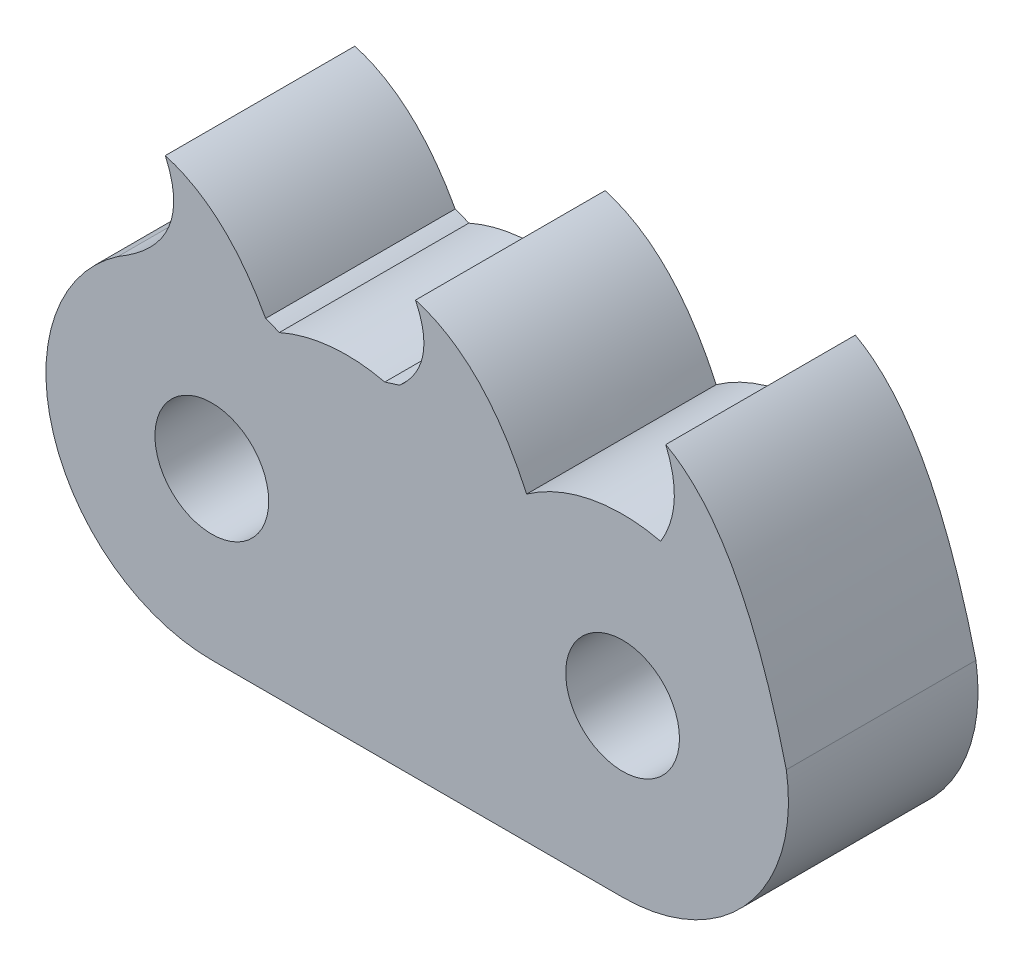
ISO-10303-21;
HEADER;
FILE_DESCRIPTION(('STEP AP214'),'2;1');
FILE_NAME('part.step','',(''),(''),'','','');
FILE_SCHEMA(('AUTOMOTIVE_DESIGN { 1 0 10303 214 1 1 1 1 }'));
ENDSEC;
DATA;
#1=APPLICATION_CONTEXT('core data for automotive mechanical design processes');
#2=APPLICATION_PROTOCOL_DEFINITION('international standard','automotive_design',2000,#1);
#3=PRODUCT_CONTEXT('',#1,'mechanical');
#4=PRODUCT('Part','Part','',(#3));
#5=PRODUCT_RELATED_PRODUCT_CATEGORY('part','',(#4));
#6=PRODUCT_DEFINITION_FORMATION('','',#4);
#7=PRODUCT_DEFINITION_CONTEXT('part definition',#1,'design');
#8=PRODUCT_DEFINITION('design','',#6,#7);
#9=PRODUCT_DEFINITION_SHAPE('','',#8);
#10=(LENGTH_UNIT() NAMED_UNIT(*) SI_UNIT(.MILLI.,.METRE.));
#11=(NAMED_UNIT(*) PLANE_ANGLE_UNIT() SI_UNIT($,.RADIAN.));
#12=(NAMED_UNIT(*) SI_UNIT($,.STERADIAN.) SOLID_ANGLE_UNIT());
#13=UNCERTAINTY_MEASURE_WITH_UNIT(LENGTH_MEASURE(1.E-05),#10,'distance_accuracy_value','');
#14=(GEOMETRIC_REPRESENTATION_CONTEXT(3) GLOBAL_UNCERTAINTY_ASSIGNED_CONTEXT((#13)) GLOBAL_UNIT_ASSIGNED_CONTEXT((#10,
#11,#12)) REPRESENTATION_CONTEXT('',''));
#15=CARTESIAN_POINT('',(0.,0.,0.));
#16=DIRECTION('',(0.,0.,1.));
#17=DIRECTION('',(1.,0.,0.));
#18=AXIS2_PLACEMENT_3D('',#15,#16,#17);
#19=CARTESIAN_POINT('',(0.,-1.75,2.));
#20=DIRECTION('',(0.,1.,0.));
#21=DIRECTION('',(-1.,0.,0.));
#22=AXIS2_PLACEMENT_3D('',#19,#20,#21);
#23=PLANE('',#22);
#24=DIRECTION('',(1.,0.,0.));
#25=VECTOR('',#24,1.);
#26=CARTESIAN_POINT('',(0.,-1.75,0.));
#27=LINE('',#26,#25);
#28=CARTESIAN_POINT('',(2.51583425125565,-1.75,0.));
#29=VERTEX_POINT('',#28);
#30=CARTESIAN_POINT('',(6.84953238319984,-1.75,0.));
#31=VERTEX_POINT('',#30);
#32=EDGE_CURVE('E625',#29,#31,#27,.T.);
#33=ORIENTED_EDGE('',*,*,#32,.T.);
#34=DIRECTION('',(0.,0.,-1.));
#35=VECTOR('',#34,1.);
#36=CARTESIAN_POINT('',(6.84953238319984,-1.75,2.));
#37=LINE('',#36,#35);
#38=CARTESIAN_POINT('',(6.84953238319984,-1.75,2.));
#39=VERTEX_POINT('',#38);
#40=EDGE_CURVE('E258',#39,#31,#37,.T.);
#41=ORIENTED_EDGE('',*,*,#40,.F.);
#42=DIRECTION('',(1.,0.,0.));
#43=VECTOR('',#42,1.);
#44=CARTESIAN_POINT('',(0.,-1.75,2.));
#45=LINE('',#44,#43);
#46=CARTESIAN_POINT('',(2.51583425125565,-1.75,2.));
#47=VERTEX_POINT('',#46);
#48=EDGE_CURVE('E246',#47,#39,#45,.T.);
#49=ORIENTED_EDGE('',*,*,#48,.F.);
#50=DIRECTION('',(0.,0.,-1.));
#51=VECTOR('',#50,1.);
#52=CARTESIAN_POINT('',(2.51583425125565,-1.75,2.));
#53=LINE('',#52,#51);
#54=EDGE_CURVE('E619',#47,#29,#53,.T.);
#55=ORIENTED_EDGE('',*,*,#54,.T.);
#56=EDGE_LOOP('',(#33,#41,#49,#55));
#57=FACE_BOUND('',#56,.T.);
#58=DIRECTION('',(-1.,0.,0.));
#59=VECTOR('',#58,1.);
#60=CARTESIAN_POINT('',(4.68268331722775,-1.75,1.5));
#61=LINE('',#60,#59);
#62=CARTESIAN_POINT('',(6.18268331722775,-1.75,1.5));
#63=VERTEX_POINT('',#62);
#64=CARTESIAN_POINT('',(3.18268331722774,-1.75,1.5));
#65=VERTEX_POINT('',#64);
#66=EDGE_CURVE('E316',#63,#65,#61,.T.);
#67=ORIENTED_EDGE('',*,*,#66,.F.);
#68=DIRECTION('',(0.,0.,-1.));
#69=VECTOR('',#68,1.);
#70=CARTESIAN_POINT('',(6.18268331722775,-1.75,1.));
#71=LINE('',#70,#69);
#72=CARTESIAN_POINT('',(6.18268331722775,-1.75,0.500000000000001));
#73=VERTEX_POINT('',#72);
#74=EDGE_CURVE('E311',#63,#73,#71,.T.);
#75=ORIENTED_EDGE('',*,*,#74,.T.);
#76=DIRECTION('',(-1.,0.,0.));
#77=VECTOR('',#76,1.);
#78=CARTESIAN_POINT('',(4.68268331722775,-1.75,0.500000000000001));
#79=LINE('',#78,#77);
#80=CARTESIAN_POINT('',(3.18268331722774,-1.75,0.500000000000025));
#81=VERTEX_POINT('',#80);
#82=EDGE_CURVE('E313',#73,#81,#79,.T.);
#83=ORIENTED_EDGE('',*,*,#82,.T.);
#84=DIRECTION('',(0.,0.,-1.));
#85=VECTOR('',#84,1.);
#86=CARTESIAN_POINT('',(3.18268331722774,-1.75,1.));
#87=LINE('',#86,#85);
#88=EDGE_CURVE('E130',#65,#81,#87,.T.);
#89=ORIENTED_EDGE('',*,*,#88,.F.);
#90=EDGE_LOOP('',(#67,#75,#83,#89));
#91=FACE_BOUND('',#90,.T.);
#92=ADVANCED_FACE('F126',(#57,#91),#23,.F.);
#93=CARTESIAN_POINT('',(6.84953238319984,0.,2.));
#94=DIRECTION('',(0.,0.,-1.));
#95=DIRECTION('',(-1.,0.,0.));
#96=AXIS2_PLACEMENT_3D('',#93,#94,#95);
#97=CYLINDRICAL_SURFACE('',#96,1.75);
#98=CARTESIAN_POINT('',(6.84953238319984,0.,0.));
#99=DIRECTION('',(0.,0.,1.));
#100=DIRECTION('',(1.,0.,0.));
#101=AXIS2_PLACEMENT_3D('',#98,#99,#100);
#102=CIRCLE('',#101,1.75);
#103=CARTESIAN_POINT('',(7.25105532154827,1.70331421939114,0.));
#104=VERTEX_POINT('',#103);
#105=CARTESIAN_POINT('',(5.83728137693173,1.42753210132354,0.));
#106=VERTEX_POINT('',#105);
#107=EDGE_CURVE('E545',#104,#106,#102,.T.);
#108=ORIENTED_EDGE('',*,*,#107,.T.);
#109=DIRECTION('',(0.,0.,-1.));
#110=VECTOR('',#109,1.);
#111=CARTESIAN_POINT('',(5.83728137693173,1.42753210132354,2.));
#112=LINE('',#111,#110);
#113=CARTESIAN_POINT('',(5.83728137693173,1.42753210132354,2.));
#114=VERTEX_POINT('',#113);
#115=EDGE_CURVE('E12',#114,#106,#112,.T.);
#116=ORIENTED_EDGE('',*,*,#115,.F.);
#117=CARTESIAN_POINT('',(6.84953238319984,0.,2.));
#118=DIRECTION('',(0.,0.,1.));
#119=DIRECTION('',(1.,0.,0.));
#120=AXIS2_PLACEMENT_3D('',#117,#118,#119);
#121=CIRCLE('',#120,1.75);
#122=CARTESIAN_POINT('',(7.25105532154827,1.70331421939114,2.));
#123=VERTEX_POINT('',#122);
#124=EDGE_CURVE('E554',#123,#114,#121,.T.);
#125=ORIENTED_EDGE('',*,*,#124,.F.);
#126=DIRECTION('',(0.,0.,-1.));
#127=VECTOR('',#126,1.);
#128=CARTESIAN_POINT('',(7.25105532154827,1.70331421939114,2.));
#129=LINE('',#128,#127);
#130=EDGE_CURVE('E263',#123,#104,#129,.T.);
#131=ORIENTED_EDGE('',*,*,#130,.T.);
#132=EDGE_LOOP('',(#108,#116,#125,#131));
#133=FACE_BOUND('',#132,.T.);
#134=ADVANCED_FACE('F128',(#133),#97,.T.);
#135=CARTESIAN_POINT('',(5.83728137693173,1.42753210132354,2.));
#136=CARTESIAN_POINT('',(5.39046219265095,2.40304552680193,2.));
#137=CARTESIAN_POINT('',(4.66492546130629,2.6140348632016,2.));
#138=B_SPLINE_CURVE_WITH_KNOTS('',2,(#135,#136,#137),.UNSPECIFIED.,.F.,.F.,(3,3),
(0.307788008353028,1.),.UNSPECIFIED.);
#139=DIRECTION('',(0.,0.,-1.));
#140=VECTOR('',#139,1.);
#141=SURFACE_OF_LINEAR_EXTRUSION('',#138,#140);
#142=CARTESIAN_POINT('',(5.83728137693173,1.42753210132354,0.));
#143=CARTESIAN_POINT('',(5.39046219265095,2.40304552680193,0.));
#144=CARTESIAN_POINT('',(4.66492546130629,2.6140348632016,0.));
#145=B_SPLINE_CURVE_WITH_KNOTS('',2,(#142,#143,#144),.UNSPECIFIED.,.F.,.F.,(3,3),
(0.307788008353028,1.),.UNSPECIFIED.);
#146=CARTESIAN_POINT('',(4.66492546130629,2.6140348632016,0.));
#147=VERTEX_POINT('',#146);
#148=EDGE_CURVE('E653',#106,#147,#145,.T.);
#149=ORIENTED_EDGE('',*,*,#148,.T.);
#150=DIRECTION('',(0.,0.,-1.));
#151=VECTOR('',#150,1.);
#152=CARTESIAN_POINT('',(4.66492546130629,2.6140348632016,2.));
#153=LINE('',#152,#151);
#154=CARTESIAN_POINT('',(4.66492546130629,2.6140348632016,2.));
#155=VERTEX_POINT('',#154);
#156=EDGE_CURVE('E136',#155,#147,#153,.T.);
#157=ORIENTED_EDGE('',*,*,#156,.F.);
#158=EDGE_CURVE('E209',#114,#155,#138,.T.);
#159=ORIENTED_EDGE('',*,*,#158,.F.);
#160=ORIENTED_EDGE('',*,*,#115,.T.);
#161=EDGE_LOOP('',(#149,#157,#159,#160));
#162=FACE_BOUND('',#161,.T.);
#163=ADVANCED_FACE('F568',(#162),#141,.F.);
#164=CARTESIAN_POINT('',(4.66492546130629,2.6140348632016,2.));
#165=CARTESIAN_POINT('',(4.82431896573802,2.28349366662164,2.));
#166=CARTESIAN_POINT('',(4.76874033175528,1.99631470279634,2.));
#167=CARTESIAN_POINT('',(4.49818955935441,1.75249797172241,2.));
#168=B_SPLINE_CURVE_WITH_KNOTS('',3,(#164,#165,#166,#167),.UNSPECIFIED.,.F.,.F.,(4,4),(0.,
0.79202093785679),.UNSPECIFIED.);
#169=DIRECTION('',(0.,0.,-1.));
#170=VECTOR('',#169,1.);
#171=SURFACE_OF_LINEAR_EXTRUSION('',#168,#170);
#172=CARTESIAN_POINT('',(4.66492546130629,2.6140348632016,0.));
#173=CARTESIAN_POINT('',(4.82431896573802,2.28349366662164,0.));
#174=CARTESIAN_POINT('',(4.76874033175528,1.99631470279634,0.));
#175=CARTESIAN_POINT('',(4.49818955935441,1.75249797172241,0.));
#176=B_SPLINE_CURVE_WITH_KNOTS('',3,(#172,#173,#174,#175),.UNSPECIFIED.,.F.,.F.,(4,4),(0.,
0.79202093785679),.UNSPECIFIED.);
#177=CARTESIAN_POINT('',(4.49818955935441,1.75249797172241,0.));
#178=VERTEX_POINT('',#177);
#179=EDGE_CURVE('E648',#147,#178,#176,.T.);
#180=ORIENTED_EDGE('',*,*,#179,.T.);
#181=DIRECTION('',(0.,0.,-1.));
#182=VECTOR('',#181,1.);
#183=CARTESIAN_POINT('',(4.49818955935441,1.75249797172241,2.));
#184=LINE('',#183,#182);
#185=CARTESIAN_POINT('',(4.49818955935441,1.75249797172241,2.));
#186=VERTEX_POINT('',#185);
#187=EDGE_CURVE('E641',#186,#178,#184,.T.);
#188=ORIENTED_EDGE('',*,*,#187,.F.);
#189=EDGE_CURVE('E560',#155,#186,#168,.T.);
#190=ORIENTED_EDGE('',*,*,#189,.F.);
#191=ORIENTED_EDGE('',*,*,#156,.T.);
#192=EDGE_LOOP('',(#180,#188,#190,#191));
#193=FACE_BOUND('',#192,.T.);
#194=ADVANCED_FACE('F571',(#193),#171,.F.);
#195=CARTESIAN_POINT('',(-0.0982208642846311,0.313799983011989,2.));
#196=DIRECTION('',(-0.298713751810146,0.954342755240226,0.));
#197=DIRECTION('',(-0.954342755240226,-0.298713751810146,0.));
#198=AXIS2_PLACEMENT_3D('',#195,#196,#197);
#199=PLANE('',#198);
#200=DIRECTION('',(0.954342755240226,0.298713751810146,0.));
#201=VECTOR('',#200,1.);
#202=CARTESIAN_POINT('',(-0.0982208642846311,0.313799983011989,0.));
#203=LINE('',#202,#201);
#204=CARTESIAN_POINT('',(4.34105532154827,1.70331421939112,0.));
#205=VERTEX_POINT('',#204);
#206=EDGE_CURVE('E656',#205,#178,#203,.T.);
#207=ORIENTED_EDGE('',*,*,#206,.F.);
#208=DIRECTION('',(0.,0.,-1.));
#209=VECTOR('',#208,1.);
#210=CARTESIAN_POINT('',(4.34105532154827,1.70331421939112,2.));
#211=LINE('',#210,#209);
#212=CARTESIAN_POINT('',(4.34105532154827,1.70331421939112,2.));
#213=VERTEX_POINT('',#212);
#214=EDGE_CURVE('E639',#213,#205,#211,.T.);
#215=ORIENTED_EDGE('',*,*,#214,.F.);
#216=DIRECTION('',(0.954342755240226,0.298713751810146,0.));
#217=VECTOR('',#216,1.);
#218=CARTESIAN_POINT('',(-0.0982208642846311,0.313799983011989,2.));
#219=LINE('',#218,#217);
#220=EDGE_CURVE('E708',#213,#186,#219,.T.);
#221=ORIENTED_EDGE('',*,*,#220,.T.);
#222=ORIENTED_EDGE('',*,*,#187,.T.);
#223=EDGE_LOOP('',(#207,#215,#221,#222));
#224=FACE_BOUND('',#223,.T.);
#225=ADVANCED_FACE('F574',(#224),#199,.T.);
#226=CARTESIAN_POINT('',(3.93953238319984,0.,2.));
#227=DIRECTION('',(0.,0.,-1.));
#228=DIRECTION('',(-1.,0.,0.));
#229=AXIS2_PLACEMENT_3D('',#226,#227,#228);
#230=CYLINDRICAL_SURFACE('',#229,1.75);
#231=CARTESIAN_POINT('',(3.93953238319984,0.,0.));
#232=DIRECTION('',(0.,0.,1.));
#233=DIRECTION('',(1.,0.,0.));
#234=AXIS2_PLACEMENT_3D('',#231,#232,#233);
#235=CIRCLE('',#234,1.75);
#236=CARTESIAN_POINT('',(3.22768331722777,1.59867786225826,0.));
#237=VERTEX_POINT('',#236);
#238=EDGE_CURVE('E658',#205,#237,#235,.T.);
#239=ORIENTED_EDGE('',*,*,#238,.T.);
#240=DIRECTION('',(0.,0.,-1.));
#241=VECTOR('',#240,1.);
#242=CARTESIAN_POINT('',(3.22768331722777,1.59867786225826,2.));
#243=LINE('',#242,#241);
#244=CARTESIAN_POINT('',(3.22768331722777,1.59867786225826,2.));
#245=VERTEX_POINT('',#244);
#246=EDGE_CURVE('E636',#245,#237,#243,.T.);
#247=ORIENTED_EDGE('',*,*,#246,.F.);
#248=CARTESIAN_POINT('',(3.93953238319984,0.,2.));
#249=DIRECTION('',(0.,0.,1.));
#250=DIRECTION('',(1.,0.,0.));
#251=AXIS2_PLACEMENT_3D('',#248,#249,#250);
#252=CIRCLE('',#251,1.75);
#253=EDGE_CURVE('E710',#213,#245,#252,.T.);
#254=ORIENTED_EDGE('',*,*,#253,.F.);
#255=ORIENTED_EDGE('',*,*,#214,.T.);
#256=EDGE_LOOP('',(#239,#247,#254,#255));
#257=FACE_BOUND('',#256,.T.);
#258=ADVANCED_FACE('F578',(#257),#230,.T.);
#259=CARTESIAN_POINT('',(2.51583425125565,0.,2.));
#260=DIRECTION('',(0.,0.,-1.));
#261=DIRECTION('',(-1.,0.,0.));
#262=AXIS2_PLACEMENT_3D('',#259,#260,#261);
#263=CYLINDRICAL_SURFACE('',#262,1.75000000000001);
#264=CARTESIAN_POINT('',(2.51583425125565,0.,0.));
#265=DIRECTION('',(0.,0.,1.));
#266=DIRECTION('',(1.,0.,0.));
#267=AXIS2_PLACEMENT_3D('',#264,#265,#266);
#268=CIRCLE('',#267,1.75000000000001);
#269=CARTESIAN_POINT('',(3.08344866121681,1.65538934441553,0.));
#270=VERTEX_POINT('',#269);
#271=EDGE_CURVE('E670',#237,#270,#268,.T.);
#272=ORIENTED_EDGE('',*,*,#271,.T.);
#273=DIRECTION('',(0.,0.,-1.));
#274=VECTOR('',#273,1.);
#275=CARTESIAN_POINT('',(3.08344866121681,1.65538934441553,2.));
#276=LINE('',#275,#274);
#277=CARTESIAN_POINT('',(3.08344866121681,1.65538934441553,2.));
#278=VERTEX_POINT('',#277);
#279=EDGE_CURVE('E633',#278,#270,#276,.T.);
#280=ORIENTED_EDGE('',*,*,#279,.F.);
#281=CARTESIAN_POINT('',(2.51583425125565,0.,2.));
#282=DIRECTION('',(0.,0.,1.));
#283=DIRECTION('',(1.,0.,0.));
#284=AXIS2_PLACEMENT_3D('',#281,#282,#283);
#285=CIRCLE('',#284,1.75000000000001);
#286=EDGE_CURVE('E599',#245,#278,#285,.T.);
#287=ORIENTED_EDGE('',*,*,#286,.F.);
#288=ORIENTED_EDGE('',*,*,#246,.T.);
#289=EDGE_LOOP('',(#272,#280,#287,#288));
#290=FACE_BOUND('',#289,.T.);
#291=ADVANCED_FACE('F582',(#290),#263,.T.);
#292=CARTESIAN_POINT('',(3.08344866121681,1.65538934441552,2.));
#293=CARTESIAN_POINT('',(2.66144855366151,2.42893109234409,2.));
#294=CARTESIAN_POINT('',(2.02492546130629,2.61403486320159,2.));
#295=B_SPLINE_CURVE_WITH_KNOTS('',2,(#292,#293,#294),.UNSPECIFIED.,.F.,.F.,(3,3),
(0.392713148098827,1.),.UNSPECIFIED.);
#296=DIRECTION('',(0.,0.,-1.));
#297=VECTOR('',#296,1.);
#298=SURFACE_OF_LINEAR_EXTRUSION('',#295,#297);
#299=CARTESIAN_POINT('',(3.08344866121681,1.65538934441552,0.));
#300=CARTESIAN_POINT('',(2.66144855366151,2.42893109234409,0.));
#301=CARTESIAN_POINT('',(2.02492546130629,2.61403486320159,0.));
#302=B_SPLINE_CURVE_WITH_KNOTS('',2,(#299,#300,#301),.UNSPECIFIED.,.F.,.F.,(3,3),
(0.392713148098827,1.),.UNSPECIFIED.);
#303=CARTESIAN_POINT('',(2.02492546130629,2.61403486320159,0.));
#304=VERTEX_POINT('',#303);
#305=EDGE_CURVE('E672',#270,#304,#302,.T.);
#306=ORIENTED_EDGE('',*,*,#305,.T.);
#307=DIRECTION('',(0.,0.,-1.));
#308=VECTOR('',#307,1.);
#309=CARTESIAN_POINT('',(2.02492546130629,2.61403486320159,2.));
#310=LINE('',#309,#308);
#311=CARTESIAN_POINT('',(2.02492546130629,2.61403486320159,2.));
#312=VERTEX_POINT('',#311);
#313=EDGE_CURVE('E630',#312,#304,#310,.T.);
#314=ORIENTED_EDGE('',*,*,#313,.F.);
#315=EDGE_CURVE('E593',#278,#312,#295,.T.);
#316=ORIENTED_EDGE('',*,*,#315,.F.);
#317=ORIENTED_EDGE('',*,*,#279,.T.);
#318=EDGE_LOOP('',(#306,#314,#316,#317));
#319=FACE_BOUND('',#318,.T.);
#320=ADVANCED_FACE('F586',(#319),#298,.F.);
#321=CARTESIAN_POINT('',(2.02492546130629,2.61403486320158,2.));
#322=CARTESIAN_POINT('',(2.34198452025452,1.91906428398839,2.));
#323=CARTESIAN_POINT('',(1.52622588148827,1.4433209187448,2.));
#324=B_SPLINE_CURVE_WITH_KNOTS('',2,(#321,#322,#323),.UNSPECIFIED.,.F.,.F.,(3,3),(0.,1.),.UNSPECIFIED.);
#325=DIRECTION('',(0.,0.,-1.));
#326=VECTOR('',#325,1.);
#327=SURFACE_OF_LINEAR_EXTRUSION('',#324,#326);
#328=CARTESIAN_POINT('',(2.02492546130629,2.61403486320158,0.));
#329=CARTESIAN_POINT('',(2.34198452025452,1.91906428398839,0.));
#330=CARTESIAN_POINT('',(1.52622588148827,1.4433209187448,0.));
#331=B_SPLINE_CURVE_WITH_KNOTS('',2,(#328,#329,#330),.UNSPECIFIED.,.F.,.F.,(3,3),(0.,1.),.UNSPECIFIED.);
#332=CARTESIAN_POINT('',(1.52622588148827,1.4433209187448,0.));
#333=VERTEX_POINT('',#332);
#334=EDGE_CURVE('E676',#304,#333,#331,.T.);
#335=ORIENTED_EDGE('',*,*,#334,.T.);
#336=DIRECTION('',(0.,0.,-1.));
#337=VECTOR('',#336,1.);
#338=CARTESIAN_POINT('',(1.52622588148827,1.4433209187448,2.));
#339=LINE('',#338,#337);
#340=CARTESIAN_POINT('',(1.52622588148827,1.4433209187448,2.));
#341=VERTEX_POINT('',#340);
#342=EDGE_CURVE('E623',#341,#333,#339,.T.);
#343=ORIENTED_EDGE('',*,*,#342,.F.);
#344=EDGE_CURVE('E598',#312,#341,#324,.T.);
#345=ORIENTED_EDGE('',*,*,#344,.F.);
#346=ORIENTED_EDGE('',*,*,#313,.T.);
#347=EDGE_LOOP('',(#335,#343,#345,#346));
#348=FACE_BOUND('',#347,.T.);
#349=ADVANCED_FACE('F590',(#348),#327,.F.);
#350=CARTESIAN_POINT('',(2.51583425125565,0.,2.));
#351=DIRECTION('',(0.,0.,-1.));
#352=DIRECTION('',(-1.,0.,0.));
#353=AXIS2_PLACEMENT_3D('',#350,#351,#352);
#354=CYLINDRICAL_SURFACE('',#353,1.75);
#355=CARTESIAN_POINT('',(2.51583425125565,0.,0.));
#356=DIRECTION('',(0.,0.,1.));
#357=DIRECTION('',(1.,0.,0.));
#358=AXIS2_PLACEMENT_3D('',#355,#356,#357);
#359=CIRCLE('',#358,1.75);
#360=EDGE_CURVE('E621',#333,#29,#359,.T.);
#361=ORIENTED_EDGE('',*,*,#360,.T.);
#362=ORIENTED_EDGE('',*,*,#54,.F.);
#363=CARTESIAN_POINT('',(2.51583425125565,0.,2.));
#364=DIRECTION('',(0.,0.,1.));
#365=DIRECTION('',(1.,0.,0.));
#366=AXIS2_PLACEMENT_3D('',#363,#364,#365);
#367=CIRCLE('',#366,1.75);
#368=EDGE_CURVE('E608',#341,#47,#367,.T.);
#369=ORIENTED_EDGE('',*,*,#368,.F.);
#370=ORIENTED_EDGE('',*,*,#342,.T.);
#371=EDGE_LOOP('',(#361,#362,#369,#370));
#372=FACE_BOUND('',#371,.T.);
#373=ADVANCED_FACE('F284',(#372),#354,.T.);
#374=CARTESIAN_POINT('',(6.84953238319984,0.,2.));
#375=DIRECTION('',(0.,0.,-1.));
#376=DIRECTION('',(-1.,0.,0.));
#377=AXIS2_PLACEMENT_3D('',#374,#375,#376);
#378=CYLINDRICAL_SURFACE('',#377,1.75);
#379=CARTESIAN_POINT('',(6.84953238319984,0.,0.));
#380=DIRECTION('',(0.,0.,1.));
#381=DIRECTION('',(1.,0.,0.));
#382=AXIS2_PLACEMENT_3D('',#379,#380,#381);
#383=CIRCLE('',#382,1.75);
#384=CARTESIAN_POINT('',(8.57715983620807,0.27893257897259,0.));
#385=VERTEX_POINT('',#384);
#386=EDGE_CURVE('E255',#31,#385,#383,.T.);
#387=ORIENTED_EDGE('',*,*,#386,.T.);
#388=DIRECTION('',(0.,0.,-1.));
#389=VECTOR('',#388,1.);
#390=CARTESIAN_POINT('',(8.57715983620807,0.27893257897259,2.));
#391=LINE('',#390,#389);
#392=CARTESIAN_POINT('',(8.57715983620807,0.27893257897259,2.));
#393=VERTEX_POINT('',#392);
#394=EDGE_CURVE('E252',#393,#385,#391,.T.);
#395=ORIENTED_EDGE('',*,*,#394,.F.);
#396=CARTESIAN_POINT('',(6.84953238319984,0.,2.));
#397=DIRECTION('',(0.,0.,1.));
#398=DIRECTION('',(1.,0.,0.));
#399=AXIS2_PLACEMENT_3D('',#396,#397,#398);
#400=CIRCLE('',#399,1.75);
#401=EDGE_CURVE('E239',#39,#393,#400,.T.);
#402=ORIENTED_EDGE('',*,*,#401,.F.);
#403=ORIENTED_EDGE('',*,*,#40,.T.);
#404=EDGE_LOOP('',(#387,#395,#402,#403));
#405=FACE_BOUND('',#404,.T.);
#406=ADVANCED_FACE('F253',(#405),#378,.T.);
#407=CARTESIAN_POINT('',(8.57715983620807,0.27893257897259,2.));
#408=CARTESIAN_POINT('',(8.11070004770232,2.17929634087259,2.));
#409=CARTESIAN_POINT('',(7.30492546130629,2.61403486320162,2.));
#410=B_SPLINE_CURVE_WITH_KNOTS('',2,(#407,#408,#409),.UNSPECIFIED.,.F.,.F.,(3,3),(0.,1.),.UNSPECIFIED.);
#411=DIRECTION('',(0.,0.,-1.));
#412=VECTOR('',#411,1.);
#413=SURFACE_OF_LINEAR_EXTRUSION('',#410,#412);
#414=CARTESIAN_POINT('',(8.57715983620807,0.27893257897259,0.));
#415=CARTESIAN_POINT('',(8.11070004770232,2.17929634087259,0.));
#416=CARTESIAN_POINT('',(7.30492546130629,2.61403486320162,0.));
#417=B_SPLINE_CURVE_WITH_KNOTS('',2,(#414,#415,#416),.UNSPECIFIED.,.F.,.F.,(3,3),(0.,1.),.UNSPECIFIED.);
#418=CARTESIAN_POINT('',(7.30492546130629,2.61403486320162,0.));
#419=VERTEX_POINT('',#418);
#420=EDGE_CURVE('E689',#385,#419,#417,.T.);
#421=ORIENTED_EDGE('',*,*,#420,.T.);
#422=DIRECTION('',(0.,0.,-1.));
#423=VECTOR('',#422,1.);
#424=CARTESIAN_POINT('',(7.30492546130629,2.61403486320162,2.));
#425=LINE('',#424,#423);
#426=CARTESIAN_POINT('',(7.30492546130629,2.61403486320162,2.));
#427=VERTEX_POINT('',#426);
#428=EDGE_CURVE('E259',#427,#419,#425,.T.);
#429=ORIENTED_EDGE('',*,*,#428,.F.);
#430=EDGE_CURVE('E243',#393,#427,#410,.T.);
#431=ORIENTED_EDGE('',*,*,#430,.F.);
#432=ORIENTED_EDGE('',*,*,#394,.T.);
#433=EDGE_LOOP('',(#421,#429,#431,#432));
#434=FACE_BOUND('',#433,.T.);
#435=ADVANCED_FACE('F261',(#434),#413,.F.);
#436=CARTESIAN_POINT('',(7.30492546130629,2.61403486320162,2.));
#437=CARTESIAN_POINT('',(7.44147862808272,2.29130715637592,2.));
#438=CARTESIAN_POINT('',(7.42352191489714,1.98773360844841,2.));
#439=CARTESIAN_POINT('',(7.25105532154827,1.70331421939114,2.));
#440=B_SPLINE_CURVE_WITH_KNOTS('',3,(#436,#437,#438,#439),.UNSPECIFIED.,.F.,.F.,(4,4),(0.,
0.66853878617915),.UNSPECIFIED.);
#441=DIRECTION('',(0.,0.,-1.));
#442=VECTOR('',#441,1.);
#443=SURFACE_OF_LINEAR_EXTRUSION('',#440,#442);
#444=CARTESIAN_POINT('',(7.30492546130629,2.61403486320162,0.));
#445=CARTESIAN_POINT('',(7.44147862808272,2.29130715637592,0.));
#446=CARTESIAN_POINT('',(7.42352191489714,1.98773360844841,0.));
#447=CARTESIAN_POINT('',(7.25105532154827,1.70331421939114,0.));
#448=B_SPLINE_CURVE_WITH_KNOTS('',3,(#444,#445,#446,#447),.UNSPECIFIED.,.F.,.F.,(4,4),(0.,
0.66853878617915),.UNSPECIFIED.);
#449=EDGE_CURVE('E201',#419,#104,#448,.T.);
#450=ORIENTED_EDGE('',*,*,#449,.T.);
#451=ORIENTED_EDGE('',*,*,#130,.F.);
#452=EDGE_CURVE('E153',#427,#123,#440,.T.);
#453=ORIENTED_EDGE('',*,*,#452,.F.);
#454=ORIENTED_EDGE('',*,*,#428,.T.);
#455=EDGE_LOOP('',(#450,#451,#453,#454));
#456=FACE_BOUND('',#455,.T.);
#457=ADVANCED_FACE('F280',(#456),#443,.F.);
#458=CARTESIAN_POINT('',(0.,0.,2.));
#459=DIRECTION('',(0.,0.,1.));
#460=DIRECTION('',(1.,0.,0.));
#461=AXIS2_PLACEMENT_3D('',#458,#459,#460);
#462=PLANE('',#461);
#463=CARTESIAN_POINT('',(6.84953238319984,0.,2.));
#464=DIRECTION('',(0.,0.,1.));
#465=DIRECTION('',(1.,0.,0.));
#466=AXIS2_PLACEMENT_3D('',#463,#464,#465);
#467=CIRCLE('',#466,0.6);
#468=CARTESIAN_POINT('',(7.44953238319984,0.,2.));
#469=VERTEX_POINT('',#468);
#470=EDGE_CURVE('E546',#469,#469,#467,.T.);
#471=ORIENTED_EDGE('',*,*,#470,.F.);
#472=EDGE_LOOP('',(#471));
#473=FACE_BOUND('',#472,.T.);
#474=CARTESIAN_POINT('',(2.51583425125565,0.,2.));
#475=DIRECTION('',(0.,0.,1.));
#476=DIRECTION('',(1.,0.,0.));
#477=AXIS2_PLACEMENT_3D('',#474,#475,#476);
#478=CIRCLE('',#477,0.6);
#479=CARTESIAN_POINT('',(3.11583425125565,0.,2.));
#480=VERTEX_POINT('',#479);
#481=EDGE_CURVE('E326',#480,#480,#478,.T.);
#482=ORIENTED_EDGE('',*,*,#481,.F.);
#483=EDGE_LOOP('',(#482));
#484=FACE_BOUND('',#483,.T.);
#485=ORIENTED_EDGE('',*,*,#124,.T.);
#486=ORIENTED_EDGE('',*,*,#158,.T.);
#487=ORIENTED_EDGE('',*,*,#189,.T.);
#488=ORIENTED_EDGE('',*,*,#220,.F.);
#489=ORIENTED_EDGE('',*,*,#253,.T.);
#490=ORIENTED_EDGE('',*,*,#286,.T.);
#491=ORIENTED_EDGE('',*,*,#315,.T.);
#492=ORIENTED_EDGE('',*,*,#344,.T.);
#493=ORIENTED_EDGE('',*,*,#368,.T.);
#494=ORIENTED_EDGE('',*,*,#48,.T.);
#495=ORIENTED_EDGE('',*,*,#401,.T.);
#496=ORIENTED_EDGE('',*,*,#430,.T.);
#497=ORIENTED_EDGE('',*,*,#452,.T.);
#498=EDGE_LOOP('',(#485,#486,#487,#488,#489,#490,#491,#492,#493,#494,#495,#496,#497));
#499=FACE_BOUND('',#498,.T.);
#500=ADVANCED_FACE('F241',(#473,#484,#499),#462,.T.);
#501=CARTESIAN_POINT('',(0.,0.,0.));
#502=DIRECTION('',(0.,0.,1.));
#503=DIRECTION('',(1.,0.,0.));
#504=AXIS2_PLACEMENT_3D('',#501,#502,#503);
#505=PLANE('',#504);
#506=CARTESIAN_POINT('',(6.84953238319984,0.,0.));
#507=DIRECTION('',(0.,0.,1.));
#508=DIRECTION('',(1.,0.,0.));
#509=AXIS2_PLACEMENT_3D('',#506,#507,#508);
#510=CIRCLE('',#509,0.6);
#511=CARTESIAN_POINT('',(7.44953238319984,0.,0.));
#512=VERTEX_POINT('',#511);
#513=EDGE_CURVE('E542',#512,#512,#510,.T.);
#514=ORIENTED_EDGE('',*,*,#513,.T.);
#515=EDGE_LOOP('',(#514));
#516=FACE_BOUND('',#515,.T.);
#517=CARTESIAN_POINT('',(2.51583425125565,0.,0.));
#518=DIRECTION('',(0.,0.,1.));
#519=DIRECTION('',(1.,0.,0.));
#520=AXIS2_PLACEMENT_3D('',#517,#518,#519);
#521=CIRCLE('',#520,0.6);
#522=CARTESIAN_POINT('',(3.11583425125565,0.,0.));
#523=VERTEX_POINT('',#522);
#524=EDGE_CURVE('E549',#523,#523,#521,.T.);
#525=ORIENTED_EDGE('',*,*,#524,.T.);
#526=EDGE_LOOP('',(#525));
#527=FACE_BOUND('',#526,.T.);
#528=ORIENTED_EDGE('',*,*,#107,.F.);
#529=ORIENTED_EDGE('',*,*,#449,.F.);
#530=ORIENTED_EDGE('',*,*,#420,.F.);
#531=ORIENTED_EDGE('',*,*,#386,.F.);
#532=ORIENTED_EDGE('',*,*,#32,.F.);
#533=ORIENTED_EDGE('',*,*,#360,.F.);
#534=ORIENTED_EDGE('',*,*,#334,.F.);
#535=ORIENTED_EDGE('',*,*,#305,.F.);
#536=ORIENTED_EDGE('',*,*,#271,.F.);
#537=ORIENTED_EDGE('',*,*,#238,.F.);
#538=ORIENTED_EDGE('',*,*,#206,.T.);
#539=ORIENTED_EDGE('',*,*,#179,.F.);
#540=ORIENTED_EDGE('',*,*,#148,.F.);
#541=EDGE_LOOP('',(#528,#529,#530,#531,#532,#533,#534,#535,#536,#537,#538,#539,#540));
#542=FACE_BOUND('',#541,.T.);
#543=ADVANCED_FACE('F652',(#516,#527,#542),#505,.F.);
#544=CARTESIAN_POINT('',(2.51583425125565,0.,0.));
#545=DIRECTION('',(0.,0.,1.));
#546=DIRECTION('',(1.,0.,0.));
#547=AXIS2_PLACEMENT_3D('',#544,#545,#546);
#548=CYLINDRICAL_SURFACE('',#547,0.6);
#549=ORIENTED_EDGE('',*,*,#524,.F.);
#550=EDGE_LOOP('',(#549));
#551=FACE_BOUND('',#550,.T.);
#552=ORIENTED_EDGE('',*,*,#481,.T.);
#553=EDGE_LOOP('',(#552));
#554=FACE_BOUND('',#553,.T.);
#555=ADVANCED_FACE('F752',(#551,#554),#548,.F.);
#556=CARTESIAN_POINT('',(6.84953238319984,0.,0.));
#557=DIRECTION('',(0.,0.,1.));
#558=DIRECTION('',(1.,0.,0.));
#559=AXIS2_PLACEMENT_3D('',#556,#557,#558);
#560=CYLINDRICAL_SURFACE('',#559,0.6);
#561=ORIENTED_EDGE('',*,*,#513,.F.);
#562=EDGE_LOOP('',(#561));
#563=FACE_BOUND('',#562,.T.);
#564=ORIENTED_EDGE('',*,*,#470,.T.);
#565=EDGE_LOOP('',(#564));
#566=FACE_BOUND('',#565,.T.);
#567=ADVANCED_FACE('F355',(#563,#566),#560,.F.);
#568=CARTESIAN_POINT('',(5.74017189963838,-0.864977164821273,1.5));
#569=DIRECTION('',(0.894427190999916,0.447213595499959,0.));
#570=DIRECTION('',(0.447213595499959,-0.894427190999916,0.));
#571=AXIS2_PLACEMENT_3D('',#568,#569,#570);
#572=PLANE('',#571);
#573=DIRECTION('',(0.447213595499959,-0.894427190999915,0.));
#574=VECTOR('',#573,1.);
#575=CARTESIAN_POINT('',(5.96142760843306,-1.30748858241064,1.5));
#576=LINE('',#575,#574);
#577=CARTESIAN_POINT('',(5.74017189963838,-0.864977164821273,1.5));
#578=VERTEX_POINT('',#577);
#579=EDGE_CURVE('E323',#578,#63,#576,.T.);
#580=ORIENTED_EDGE('',*,*,#579,.F.);
#581=DIRECTION('',(0.,0.,-1.));
#582=VECTOR('',#581,1.);
#583=CARTESIAN_POINT('',(5.74017189963838,-0.864977164821273,1.));
#584=LINE('',#583,#582);
#585=CARTESIAN_POINT('',(5.74017189963838,-0.864977164821273,0.500000000000001));
#586=VERTEX_POINT('',#585);
#587=EDGE_CURVE('E384',#578,#586,#584,.T.);
#588=ORIENTED_EDGE('',*,*,#587,.T.);
#589=DIRECTION('',(0.447213595499959,-0.894427190999915,0.));
#590=VECTOR('',#589,1.);
#591=CARTESIAN_POINT('',(5.96142760843306,-1.30748858241064,0.500000000000001));
#592=LINE('',#591,#590);
#593=EDGE_CURVE('E408',#586,#73,#592,.T.);
#594=ORIENTED_EDGE('',*,*,#593,.T.);
#595=ORIENTED_EDGE('',*,*,#74,.F.);
#596=EDGE_LOOP('',(#580,#588,#594,#595));
#597=FACE_BOUND('',#596,.T.);
#598=ADVANCED_FACE('F344',(#597),#572,.F.);
#599=CARTESIAN_POINT('',(3.18268331722774,-1.75,1.5));
#600=CARTESIAN_POINT('',(3.18268331722774,-1.75,0.5));
#601=CARTESIAN_POINT('',(3.21955926869353,-1.67624809706844,1.5));
#602=CARTESIAN_POINT('',(3.21955926869353,-1.67624809706844,0.500000000000001));
#603=CARTESIAN_POINT('',(3.29331117162509,-1.52874429120532,1.5));
#604=CARTESIAN_POINT('',(3.29331117162509,-1.52874429120532,0.500000000000001));
#605=CARTESIAN_POINT('',(3.40393902602243,-1.30748858241064,1.5));
#606=CARTESIAN_POINT('',(3.40393902602243,-1.30748858241064,0.500000000000001));
#607=CARTESIAN_POINT('',(3.51456688041977,-1.08623287361596,1.5));
#608=CARTESIAN_POINT('',(3.51456688041977,-1.08623287361596,0.500000000000001));
#609=CARTESIAN_POINT('',(3.58834009278165,-0.938686448892191,1.5));
#610=CARTESIAN_POINT('',(3.58834009278165,-0.938686448892191,0.5));
#611=CARTESIAN_POINT('',(3.67870969448504,-0.757947245485417,1.5));
#612=CARTESIAN_POINT('',(3.67870969448504,-0.757947245485417,0.500000000000001));
#613=CARTESIAN_POINT('',(3.78377544634851,-0.543015437318166,1.5));
#614=CARTESIAN_POINT('',(3.78377544634851,-0.543015437318166,0.500000000000001));
#615=CARTESIAN_POINT('',(3.93558498605423,-0.217797228625209,1.5));
#616=CARTESIAN_POINT('',(3.93558498605423,-0.217797228625209,0.5));
#617=CARTESIAN_POINT('',(4.08153451424278,0.110092623051633,1.5));
#618=CARTESIAN_POINT('',(4.08153451424278,0.110092623051633,0.500000000000001));
#619=CARTESIAN_POINT('',(4.1748996077952,0.330404865082299,1.5));
#620=CARTESIAN_POINT('',(4.1748996077952,0.330404865082299,0.500000000000001));
#621=CARTESIAN_POINT('',(4.25811017208123,0.531765281121926,1.5));
#622=CARTESIAN_POINT('',(4.25811017208123,0.531765281121926,0.500000000000001));
#623=CARTESIAN_POINT('',(4.38802116405715,0.690444525895376,1.5));
#624=CARTESIAN_POINT('',(4.38802116405715,0.690444525895376,0.5));
#625=CARTESIAN_POINT('',(4.68268331722775,0.779920410617761,1.5));
#626=CARTESIAN_POINT('',(4.68268331722775,0.779920410617761,0.500000000000001));
#627=CARTESIAN_POINT('',(4.97734547039833,0.690444525895379,1.5));
#628=CARTESIAN_POINT('',(4.97734547039833,0.690444525895379,0.5));
#629=CARTESIAN_POINT('',(5.10725646237426,0.53176528112193,1.5));
#630=CARTESIAN_POINT('',(5.10725646237426,0.53176528112193,0.500000000000001));
#631=CARTESIAN_POINT('',(5.19046702666029,0.3304048650823,1.5));
#632=CARTESIAN_POINT('',(5.19046702666029,0.3304048650823,0.500000000000001));
#633=CARTESIAN_POINT('',(5.28383212021272,0.110092623051633,1.5));
#634=CARTESIAN_POINT('',(5.28383212021272,0.110092623051633,0.5));
#635=CARTESIAN_POINT('',(5.42978164840126,-0.217797228625209,1.5));
#636=CARTESIAN_POINT('',(5.42978164840126,-0.217797228625209,0.500000000000001));
#637=CARTESIAN_POINT('',(5.581591188107,-0.543015437318166,1.5));
#638=CARTESIAN_POINT('',(5.581591188107,-0.543015437318166,0.5));
#639=CARTESIAN_POINT('',(5.68667161533285,-0.757976596210199,1.5));
#640=CARTESIAN_POINT('',(5.68667161533285,-0.757976596210199,0.500000000000001));
#641=CARTESIAN_POINT('',(5.74017189963838,-0.864977164821273,1.5));
#642=CARTESIAN_POINT('',(5.74017189963838,-0.864977164821273,0.500000000000001));
#643=B_SPLINE_SURFACE_WITH_KNOTS('',3,1,((#599,#600),(#601,#602),(#603,#604),(#605,#606),(#607,
#608),(#609,#610),(#611,#612),(#613,#614),(#615,#616),(#617,#618),(#619,#620),(#621,#622),(#623,
#624),(#625,#626),(#627,#628),(#629,#630),(#631,#632),(#633,#634),(#635,#636),(#637,#638),(#639,
#640),(#641,#642)),.UNSPECIFIED.,.F.,.F.,.F.,(4,1,1,1,2,1,1,1,2,1,1,1,2,1,1,1,4),(2,2),(0.,
0.0490503493997491,0.0981006987994982,0.147151048199247,0.196201397598997,0.26742519261781,
0.338648987636624,0.409872782655438,0.481096577674252,0.539598638236875,0.598100698799498,
0.656602759362121,0.715104819924745,0.786328614943558,0.857552409962372,0.928776204981186,1.),
(0.,1.),.UNSPECIFIED.);
#644=DIRECTION('',(0.447213595499958,0.894427190999916,0.));
#645=VECTOR('',#644,1.);
#646=CARTESIAN_POINT('',(3.18268331722774,-1.75,1.5));
#647=LINE('',#646,#645);
#648=CARTESIAN_POINT('',(3.62519473481672,-0.864977164822053,1.5));
#649=VERTEX_POINT('',#648);
#650=EDGE_CURVE('E486',#65,#649,#647,.T.);
#651=DIRECTION('',(0.447213595499958,0.894427190999916,0.));
#652=VECTOR('',#651,1.);
#653=CARTESIAN_POINT('',(3.18268331722774,-1.75,0.500000000000001));
#654=LINE('',#653,#652);
#655=CARTESIAN_POINT('',(3.62519473481672,-0.864977164822053,0.500000000000001));
#656=VERTEX_POINT('',#655);
#657=EDGE_CURVE('E538',#81,#656,#654,.T.);
#658=CARTESIAN_POINT('',(-14.2633490851812,8.07929474517789,0.500000000000001));
#659=DIRECTION('',(0.,0.,1.));
#660=DIRECTION('',(-1.,0.,0.));
#661=AXIS2_PLACEMENT_3D('',#658,#659,#660);
#662=CIRCLE('',#661,20.);
#663=CARTESIAN_POINT('',(4.22058496594948,0.440958408418972,0.500000000000001));
#664=VERTEX_POINT('',#663);
#665=EDGE_CURVE('E526',#656,#664,#662,.T.);
#666=CARTESIAN_POINT('',(4.68268331722775,0.249999999999999,0.500000000000001));
#667=DIRECTION('',(0.,0.,-1.));
#668=DIRECTION('',(-1.,0.,0.));
#669=AXIS2_PLACEMENT_3D('',#666,#667,#668);
#670=CIRCLE('',#669,0.500000000000002);
#671=CARTESIAN_POINT('',(5.14478166850662,0.440958408417519,0.500000000000001));
#672=VERTEX_POINT('',#671);
#673=EDGE_CURVE('E383',#664,#672,#670,.T.);
#674=CARTESIAN_POINT('',(23.6287157196367,8.07929474517789,0.500000000000001));
#675=DIRECTION('',(0.,0.,1.));
#676=DIRECTION('',(-1.,0.,0.));
#677=AXIS2_PLACEMENT_3D('',#674,#675,#676);
#678=CIRCLE('',#677,20.);
#679=EDGE_CURVE('E374',#672,#586,#678,.T.);
#680=CARTESIAN_POINT('',(23.6287157196367,8.07929474517789,1.5));
#681=DIRECTION('',(0.,0.,1.));
#682=DIRECTION('',(-1.,0.,0.));
#683=AXIS2_PLACEMENT_3D('',#680,#681,#682);
#684=CIRCLE('',#683,20.);
#685=CARTESIAN_POINT('',(5.14478166850662,0.440958408417519,1.5));
#686=VERTEX_POINT('',#685);
#687=EDGE_CURVE('E401',#686,#578,#684,.T.);
#688=CARTESIAN_POINT('',(4.68268331722775,0.249999999999999,1.5));
#689=DIRECTION('',(0.,0.,-1.));
#690=DIRECTION('',(-1.,0.,0.));
#691=AXIS2_PLACEMENT_3D('',#688,#689,#690);
#692=CIRCLE('',#691,0.500000000000002);
#693=CARTESIAN_POINT('',(4.22058496594948,0.440958408418972,1.5));
#694=VERTEX_POINT('',#693);
#695=EDGE_CURVE('E487',#694,#686,#692,.T.);
#696=CARTESIAN_POINT('',(-14.2633490851812,8.07929474517789,1.5));
#697=DIRECTION('',(0.,0.,1.));
#698=DIRECTION('',(-1.,0.,0.));
#699=AXIS2_PLACEMENT_3D('',#696,#697,#698);
#700=CIRCLE('',#699,20.);
#701=EDGE_CURVE('E478',#649,#694,#700,.T.);
#702=ORIENTED_EDGE('',*,*,#650,.F.);
#703=ORIENTED_EDGE('',*,*,#88,.T.);
#704=ORIENTED_EDGE('',*,*,#657,.T.);
#705=ORIENTED_EDGE('',*,*,#665,.T.);
#706=ORIENTED_EDGE('',*,*,#673,.T.);
#707=ORIENTED_EDGE('',*,*,#679,.T.);
#708=ORIENTED_EDGE('',*,*,#587,.F.);
#709=ORIENTED_EDGE('',*,*,#687,.F.);
#710=ORIENTED_EDGE('',*,*,#695,.F.);
#711=ORIENTED_EDGE('',*,*,#701,.F.);
#712=EDGE_LOOP('',(#702,#703,#704,#705,#706,#707,#708,#709,#710,#711));
#713=FACE_BOUND('',#712,.T.);
#714=ADVANCED_FACE('F354',(#713),#643,.F.);
#715=CARTESIAN_POINT('',(4.26518849196206,0.524943839216898,1.5));
#716=DIRECTION('',(-7.22755607499958E-13,3.61377803749983E-13,-1.));
#717=DIRECTION('',(-1.,0.,7.22755607499958E-13));
#718=AXIS2_PLACEMENT_3D('',#715,#716,#717);
#719=PLANE('',#718);
#720=ORIENTED_EDGE('',*,*,#650,.T.);
#721=ORIENTED_EDGE('',*,*,#701,.T.);
#722=ORIENTED_EDGE('',*,*,#695,.T.);
#723=ORIENTED_EDGE('',*,*,#687,.T.);
#724=ORIENTED_EDGE('',*,*,#579,.T.);
#725=ORIENTED_EDGE('',*,*,#66,.T.);
#726=EDGE_LOOP('',(#720,#721,#722,#723,#724,#725));
#727=FACE_BOUND('',#726,.T.);
#728=ADVANCED_FACE('F424',(#727),#719,.T.);
#729=CARTESIAN_POINT('',(4.26518849196206,0.524943839216898,0.5));
#730=DIRECTION('',(5.13403578183334E-13,-2.55231722382352E-13,-1.));
#731=DIRECTION('',(-1.,0.,-5.13403578183334E-13));
#732=AXIS2_PLACEMENT_3D('',#729,#730,#731);
#733=PLANE('',#732);
#734=ORIENTED_EDGE('',*,*,#593,.F.);
#735=ORIENTED_EDGE('',*,*,#679,.F.);
#736=ORIENTED_EDGE('',*,*,#673,.F.);
#737=ORIENTED_EDGE('',*,*,#665,.F.);
#738=ORIENTED_EDGE('',*,*,#657,.F.);
#739=ORIENTED_EDGE('',*,*,#82,.F.);
#740=EDGE_LOOP('',(#734,#735,#736,#737,#738,#739));
#741=FACE_BOUND('',#740,.T.);
#742=ADVANCED_FACE('F356',(#741),#733,.F.);
#743=CLOSED_SHELL('',(#92,#134,#163,#194,#225,#258,#291,#320,#349,#373,#406,#435,#457,#500,#543,
#555,#567,#598,#714,#728,#742));
#744=MANIFOLD_SOLID_BREP('B2',#743);
#745=ADVANCED_BREP_SHAPE_REPRESENTATION('',(#18,#744),#14);
#746=SHAPE_DEFINITION_REPRESENTATION(#9,#745);
ENDSEC;
END-ISO-10303-21;
